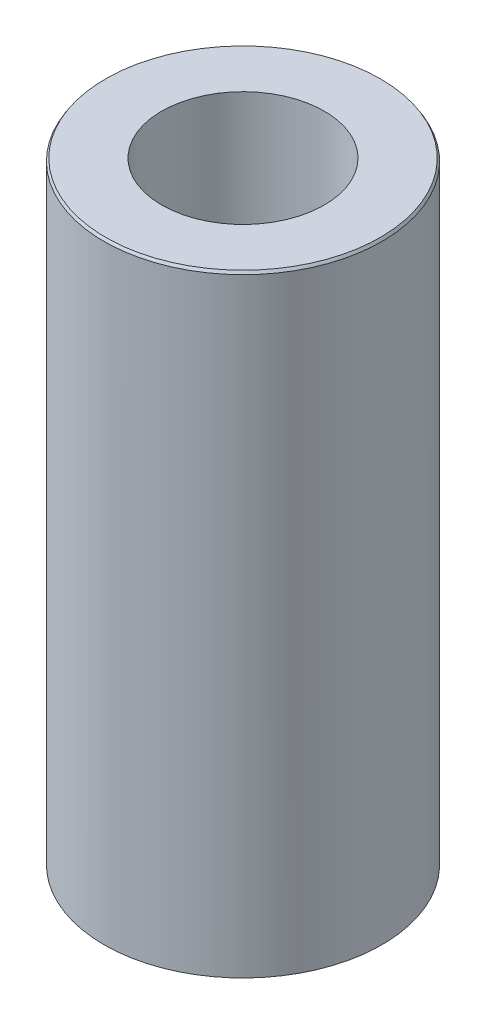
ISO-10303-21;
HEADER;
FILE_DESCRIPTION(('STEP AP214'),'2;1');
FILE_NAME('part.step','',(''),(''),'','','');
FILE_SCHEMA(('AUTOMOTIVE_DESIGN { 1 0 10303 214 1 1 1 1 }'));
ENDSEC;
DATA;
#1=APPLICATION_CONTEXT('core data for automotive mechanical design processes');
#2=APPLICATION_PROTOCOL_DEFINITION('international standard','automotive_design',2000,#1);
#3=PRODUCT_CONTEXT('',#1,'mechanical');
#4=PRODUCT('Part','Part','',(#3));
#5=PRODUCT_RELATED_PRODUCT_CATEGORY('part','',(#4));
#6=PRODUCT_DEFINITION_FORMATION('','',#4);
#7=PRODUCT_DEFINITION_CONTEXT('part definition',#1,'design');
#8=PRODUCT_DEFINITION('design','',#6,#7);
#9=PRODUCT_DEFINITION_SHAPE('','',#8);
#10=(LENGTH_UNIT() NAMED_UNIT(*) SI_UNIT(.MILLI.,.METRE.));
#11=(NAMED_UNIT(*) PLANE_ANGLE_UNIT() SI_UNIT($,.RADIAN.));
#12=(NAMED_UNIT(*) SI_UNIT($,.STERADIAN.) SOLID_ANGLE_UNIT());
#13=UNCERTAINTY_MEASURE_WITH_UNIT(LENGTH_MEASURE(1.E-05),#10,'distance_accuracy_value','');
#14=(GEOMETRIC_REPRESENTATION_CONTEXT(3) GLOBAL_UNCERTAINTY_ASSIGNED_CONTEXT((#13)) GLOBAL_UNIT_ASSIGNED_CONTEXT((#10,
#11,#12)) REPRESENTATION_CONTEXT('',''));
#15=CARTESIAN_POINT('',(0.,0.,0.));
#16=DIRECTION('',(0.,0.,1.));
#17=DIRECTION('',(1.,0.,0.));
#18=AXIS2_PLACEMENT_3D('',#15,#16,#17);
#19=CARTESIAN_POINT('',(0.,55.1560299572397,0.));
#20=DIRECTION('',(0.,-1.,0.));
#21=DIRECTION('',(0.,0.,-1.));
#22=AXIS2_PLACEMENT_3D('',#19,#20,#21);
#23=CYLINDRICAL_SURFACE('',#22,12.5);
#24=CARTESIAN_POINT('',(0.,54.9144210409937,0.));
#25=DIRECTION('',(0.,1.,0.));
#26=DIRECTION('',(0.,0.,1.));
#27=AXIS2_PLACEMENT_3D('',#24,#25,#26);
#28=CIRCLE('',#27,12.5);
#29=CARTESIAN_POINT('',(0.,54.9144210409937,-12.5));
#30=VERTEX_POINT('',#29);
#31=EDGE_CURVE('E50',#30,#30,#28,.F.);
#32=ORIENTED_EDGE('',*,*,#31,.T.);
#33=EDGE_LOOP('',(#32));
#34=FACE_BOUND('',#33,.T.);
#35=CARTESIAN_POINT('',(0.,0.150368298617212,0.));
#36=DIRECTION('',(0.,1.,0.));
#37=DIRECTION('',(0.,0.,1.));
#38=AXIS2_PLACEMENT_3D('',#35,#36,#37);
#39=CIRCLE('',#38,12.5);
#40=CARTESIAN_POINT('',(0.,0.150368298617212,12.5));
#41=VERTEX_POINT('',#40);
#42=EDGE_CURVE('E51',#41,#41,#39,.T.);
#43=ORIENTED_EDGE('',*,*,#42,.T.);
#44=EDGE_LOOP('',(#43));
#45=FACE_BOUND('',#44,.T.);
#46=ADVANCED_FACE('F39',(#34,#45),#23,.T.);
#47=CARTESIAN_POINT('',(0.,55.1560299572397,0.));
#48=DIRECTION('',(0.,1.,0.));
#49=DIRECTION('',(0.,0.,1.));
#50=AXIS2_PLACEMENT_3D('',#47,#48,#49);
#51=PLANE('',#50);
#52=CARTESIAN_POINT('',(0.,55.1560299572397,0.));
#53=DIRECTION('',(0.,1.,0.));
#54=DIRECTION('',(0.,0.,1.));
#55=AXIS2_PLACEMENT_3D('',#52,#53,#54);
#56=CIRCLE('',#55,12.3496317013828);
#57=CARTESIAN_POINT('',(0.,55.1560299572397,-12.3496317013828));
#58=VERTEX_POINT('',#57);
#59=EDGE_CURVE('E54',#58,#58,#56,.T.);
#60=ORIENTED_EDGE('',*,*,#59,.T.);
#61=EDGE_LOOP('',(#60));
#62=FACE_BOUND('',#61,.T.);
#63=CARTESIAN_POINT('',(0.,55.1560299572397,0.));
#64=DIRECTION('',(0.,1.,0.));
#65=DIRECTION('',(0.,0.,1.));
#66=AXIS2_PLACEMENT_3D('',#63,#64,#65);
#67=CIRCLE('',#66,7.3146631483631);
#68=CARTESIAN_POINT('',(0.,55.1560299572397,7.3146631483631));
#69=VERTEX_POINT('',#68);
#70=EDGE_CURVE('E58',#69,#69,#67,.T.);
#71=ORIENTED_EDGE('',*,*,#70,.F.);
#72=EDGE_LOOP('',(#71));
#73=FACE_BOUND('',#72,.T.);
#74=ADVANCED_FACE('F69',(#62,#73),#51,.T.);
#75=CARTESIAN_POINT('',(0.,0.,0.));
#76=DIRECTION('',(0.,1.,0.));
#77=DIRECTION('',(0.,0.,1.));
#78=AXIS2_PLACEMENT_3D('',#75,#76,#77);
#79=PLANE('',#78);
#80=CARTESIAN_POINT('',(0.,0.,0.));
#81=DIRECTION('',(0.,1.,0.));
#82=DIRECTION('',(0.,0.,1.));
#83=AXIS2_PLACEMENT_3D('',#80,#81,#82);
#84=CIRCLE('',#83,12.258391083754);
#85=CARTESIAN_POINT('',(0.,0.,12.258391083754));
#86=VERTEX_POINT('',#85);
#87=EDGE_CURVE('E10',#86,#86,#84,.F.);
#88=ORIENTED_EDGE('',*,*,#87,.T.);
#89=EDGE_LOOP('',(#88));
#90=FACE_BOUND('',#89,.T.);
#91=CARTESIAN_POINT('',(0.,0.,0.));
#92=DIRECTION('',(0.,1.,0.));
#93=DIRECTION('',(0.,0.,1.));
#94=AXIS2_PLACEMENT_3D('',#91,#92,#93);
#95=CIRCLE('',#94,7.3146631483631);
#96=CARTESIAN_POINT('',(0.,0.,7.3146631483631));
#97=VERTEX_POINT('',#96);
#98=EDGE_CURVE('E63',#97,#97,#95,.T.);
#99=ORIENTED_EDGE('',*,*,#98,.T.);
#100=EDGE_LOOP('',(#99));
#101=FACE_BOUND('',#100,.T.);
#102=ADVANCED_FACE('F75',(#90,#101),#79,.F.);
#103=CARTESIAN_POINT('',(0.,55.1560299572397,0.));
#104=DIRECTION('',(0.,-1.,0.));
#105=DIRECTION('',(0.,0.,-1.));
#106=AXIS2_PLACEMENT_3D('',#103,#104,#105);
#107=CYLINDRICAL_SURFACE('',#106,7.3146631483631);
#108=ORIENTED_EDGE('',*,*,#70,.T.);
#109=EDGE_LOOP('',(#108));
#110=FACE_BOUND('',#109,.T.);
#111=ORIENTED_EDGE('',*,*,#98,.F.);
#112=EDGE_LOOP('',(#111));
#113=FACE_BOUND('',#112,.T.);
#114=ADVANCED_FACE('F70',(#110,#113),#107,.F.);
#115=CARTESIAN_POINT('',(0.,55.1560299572397,0.));
#116=DIRECTION('',(0.,-1.,0.));
#117=DIRECTION('',(0.,0.,-1.));
#118=AXIS2_PLACEMENT_3D('',#115,#116,#117);
#119=CONICAL_SURFACE('',#118,12.3496317013828,0.55670034644072);
#120=CARTESIAN_POINT('',(0.,54.9144210409937,-12.5));
#121=CARTESIAN_POINT('',(0.,54.9169378005379,-12.4984336635561));
#122=CARTESIAN_POINT('',(0.,54.9194545600822,-12.4968673271121));
#123=CARTESIAN_POINT('',(0.,54.9244880791706,-12.4937346542243));
#124=CARTESIAN_POINT('',(0.,54.9270048387149,-12.4921683177804));
#125=CARTESIAN_POINT('',(0.,54.9320383578033,-12.4890356448925));
#126=CARTESIAN_POINT('',(0.,54.9345551173475,-12.4874693084486));
#127=CARTESIAN_POINT('',(0.,54.939588636436,-12.4843366355607));
#128=CARTESIAN_POINT('',(0.,54.9421053959802,-12.4827702991168));
#129=CARTESIAN_POINT('',(0.,54.9471389150687,-12.4796376262289));
#130=CARTESIAN_POINT('',(0.,54.9496556746129,-12.478071289785));
#131=CARTESIAN_POINT('',(0.,54.9546891937014,-12.4749386168971));
#132=CARTESIAN_POINT('',(0.,54.9572059532456,-12.4733722804532));
#133=CARTESIAN_POINT('',(0.,54.962239472334,-12.4702396075653));
#134=CARTESIAN_POINT('',(0.,54.9647562318783,-12.4686732711214));
#135=CARTESIAN_POINT('',(0.,54.9697897509667,-12.4655405982336));
#136=CARTESIAN_POINT('',(0.,54.972306510511,-12.4639742617896));
#137=CARTESIAN_POINT('',(0.,54.9773400295994,-12.4608415889018));
#138=CARTESIAN_POINT('',(0.,54.9798567891437,-12.4592752524578));
#139=CARTESIAN_POINT('',(0.,54.9848903082321,-12.45614257957));
#140=CARTESIAN_POINT('',(0.,54.9874070677763,-12.4545762431261));
#141=CARTESIAN_POINT('',(0.,54.9924405868648,-12.4514435702382));
#142=CARTESIAN_POINT('',(0.,54.994957346409,-12.4498772337943));
#143=CARTESIAN_POINT('',(0.,54.9999908654975,-12.4467445609064));
#144=CARTESIAN_POINT('',(0.,55.0025076250417,-12.4451782244625));
#145=CARTESIAN_POINT('',(0.,55.0075411441302,-12.4420455515746));
#146=CARTESIAN_POINT('',(0.,55.0100579036744,-12.4404792151307));
#147=CARTESIAN_POINT('',(0.,55.0150914227629,-12.4373465422428));
#148=CARTESIAN_POINT('',(0.,55.0176081823071,-12.4357802057989));
#149=CARTESIAN_POINT('',(0.,55.0226417013955,-12.432647532911));
#150=CARTESIAN_POINT('',(0.,55.0251584609398,-12.4310811964671));
#151=CARTESIAN_POINT('',(0.,55.0301919800282,-12.4279485235793));
#152=CARTESIAN_POINT('',(0.,55.0327087395725,-12.4263821871353));
#153=CARTESIAN_POINT('',(0.,55.0377422586609,-12.4232495142475));
#154=CARTESIAN_POINT('',(0.,55.0402590182051,-12.4216831778035));
#155=CARTESIAN_POINT('',(0.,55.0452925372936,-12.4185505049157));
#156=CARTESIAN_POINT('',(0.,55.0478092968378,-12.4169841684718));
#157=CARTESIAN_POINT('',(0.,55.0528428159263,-12.4138514955839));
#158=CARTESIAN_POINT('',(0.,55.0553595754705,-12.41228515914));
#159=CARTESIAN_POINT('',(0.,55.060393094559,-12.4091524862521));
#160=CARTESIAN_POINT('',(0.,55.0629098541032,-12.4075861498082));
#161=CARTESIAN_POINT('',(0.,55.0679433731917,-12.4044534769203));
#162=CARTESIAN_POINT('',(0.,55.0704601327359,-12.4028871404764));
#163=CARTESIAN_POINT('',(0.,55.0754936518243,-12.3997544675885));
#164=CARTESIAN_POINT('',(0.,55.0780104113686,-12.3981881311446));
#165=CARTESIAN_POINT('',(0.,55.083043930457,-12.3950554582567));
#166=CARTESIAN_POINT('',(0.,55.0855606900013,-12.3934891218128));
#167=CARTESIAN_POINT('',(0.,55.0905942090897,-12.390356448925));
#168=CARTESIAN_POINT('',(0.,55.093110968634,-12.388790112481));
#169=CARTESIAN_POINT('',(0.,55.0981444877224,-12.3856574395932));
#170=CARTESIAN_POINT('',(0.,55.1006612472666,-12.3840911031492));
#171=CARTESIAN_POINT('',(0.,55.1056947663551,-12.3809584302614));
#172=CARTESIAN_POINT('',(0.,55.1082115258993,-12.3793920938175));
#173=CARTESIAN_POINT('',(0.,55.1132450449878,-12.3762594209296));
#174=CARTESIAN_POINT('',(0.,55.115761804532,-12.3746930844857));
#175=CARTESIAN_POINT('',(0.,55.1207953236205,-12.3715604115978));
#176=CARTESIAN_POINT('',(0.,55.1233120831647,-12.3699940751539));
#177=CARTESIAN_POINT('',(0.,55.1283456022532,-12.366861402266));
#178=CARTESIAN_POINT('',(0.,55.1308623617974,-12.3652950658221));
#179=CARTESIAN_POINT('',(0.,55.1358958808858,-12.3621623929342));
#180=CARTESIAN_POINT('',(0.,55.1384126404301,-12.3605960564903));
#181=CARTESIAN_POINT('',(0.,55.1434461595185,-12.3574633836024));
#182=CARTESIAN_POINT('',(0.,55.1459629190628,-12.3558970471585));
#183=CARTESIAN_POINT('',(0.,55.1509964381512,-12.3527643742707));
#184=CARTESIAN_POINT('',(0.,55.1535131976954,-12.3511980378267));
#185=CARTESIAN_POINT('',(0.,55.1560299572397,-12.3496317013828));
#186=B_SPLINE_CURVE_WITH_KNOTS('',3,(#120,#121,#122,#123,#124,#125,#126,#127,#128,#129,#130,
#131,#132,#133,#134,#135,#136,#137,#138,#139,#140,#141,#142,#143,#144,#145,#146,#147,#148,#149,
#150,#151,#152,#153,#154,#155,#156,#157,#158,#159,#160,#161,#162,#163,#164,#165,#166,#167,#168,
#169,#170,#171,#172,#173,#174,#175,#176,#177,#178,#179,#180,#181,#182,#183,#184,#185),
.UNSPECIFIED.,.F.,.F.,(4,2,2,2,2,2,2,2,2,2,2,2,2,2,2,2,2,2,2,2,2,2,2,2,2,2,2,2,2,2,2,2,4),(0.,
0.00889310947483226,0.0177862189496704,0.0266793284245086,0.0355724378993408,0.044465547374179,
0.0533586568490171,0.0622517663238553,0.0711448757986875,0.0800379852735257,0.0889310947483638,
0.0978242042231961,0.106717313698035,0.115610423172873,0.124503532647711,0.133396642122544,
0.142289751597382,0.15118286107222,0.160075970547052,0.16896908002189,0.177862189496729,
0.186755298971567,0.195648408446399,0.204541517921237,0.213434627396075,0.222327736870908,
0.231220846345746,0.240113955820584,0.249007065295423,0.257900174770255,0.266793284245093,
0.275686393719931,0.28457950319477),.UNSPECIFIED.);
#187=EDGE_CURVE('BSEAM81',#30,#58,#186,.T.);
#188=ORIENTED_EDGE('',*,*,#31,.F.);
#189=ORIENTED_EDGE('',*,*,#59,.F.);
#190=ORIENTED_EDGE('',*,*,#187,.T.);
#191=ORIENTED_EDGE('',*,*,#187,.F.);
#192=EDGE_LOOP('',(#188,#190,#189,#191));
#193=FACE_BOUND('',#192,.T.);
#194=ADVANCED_FACE('F81',(#193),#119,.T.);
#195=CARTESIAN_POINT('',(0.,0.150368298617212,0.));
#196=DIRECTION('',(0.,1.,0.));
#197=DIRECTION('',(0.,0.,1.));
#198=AXIS2_PLACEMENT_3D('',#195,#196,#197);
#199=CONICAL_SURFACE('',#198,12.5,1.0140959803542);
#200=ORIENTED_EDGE('',*,*,#87,.F.);
#201=EDGE_LOOP('',(#200));
#202=FACE_BOUND('',#201,.T.);
#203=ORIENTED_EDGE('',*,*,#42,.F.);
#204=EDGE_LOOP('',(#203));
#205=FACE_BOUND('',#204,.T.);
#206=ADVANCED_FACE('F45',(#202,#205),#199,.T.);
#207=CLOSED_SHELL('',(#46,#74,#102,#114,#194,#206));
#208=MANIFOLD_SOLID_BREP('B2',#207);
#209=ADVANCED_BREP_SHAPE_REPRESENTATION('',(#18,#208),#14);
#210=SHAPE_DEFINITION_REPRESENTATION(#9,#209);
ENDSEC;
END-ISO-10303-21;
